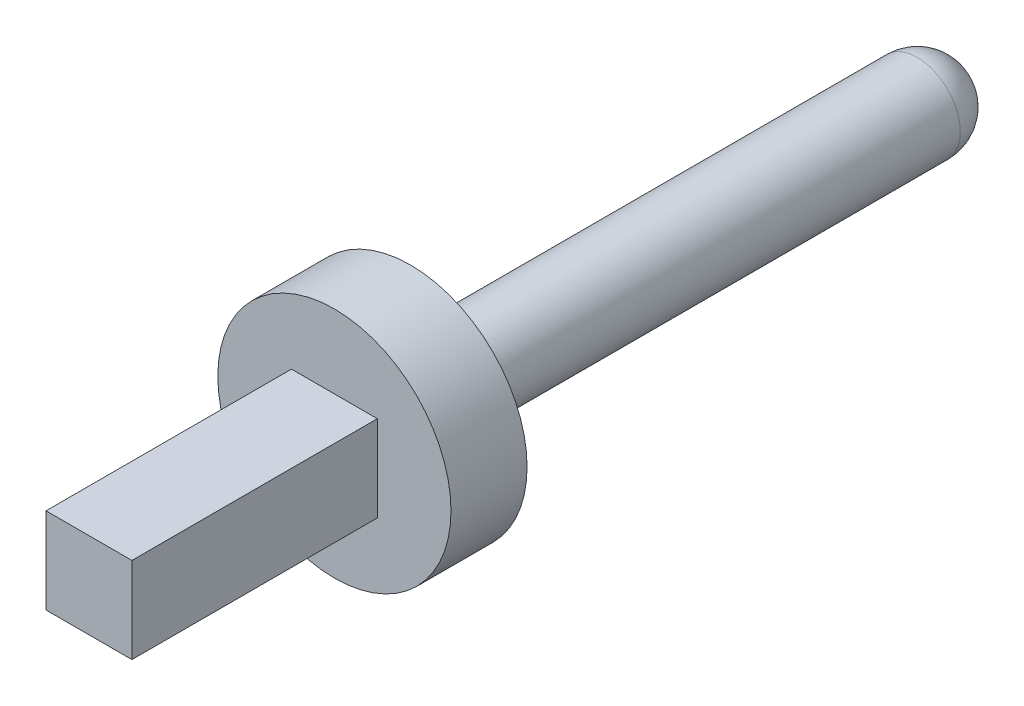
ISO-10303-21;
HEADER;
FILE_DESCRIPTION(('STEP AP214'),'2;1');
FILE_NAME('part.step','',(''),(''),'','','');
FILE_SCHEMA(('AUTOMOTIVE_DESIGN { 1 0 10303 214 1 1 1 1 }'));
ENDSEC;
DATA;
#1=APPLICATION_CONTEXT('core data for automotive mechanical design processes');
#2=APPLICATION_PROTOCOL_DEFINITION('international standard','automotive_design',2000,#1);
#3=PRODUCT_CONTEXT('',#1,'mechanical');
#4=PRODUCT('Part','Part','',(#3));
#5=PRODUCT_RELATED_PRODUCT_CATEGORY('part','',(#4));
#6=PRODUCT_DEFINITION_FORMATION('','',#4);
#7=PRODUCT_DEFINITION_CONTEXT('part definition',#1,'design');
#8=PRODUCT_DEFINITION('design','',#6,#7);
#9=PRODUCT_DEFINITION_SHAPE('','',#8);
#10=(LENGTH_UNIT() NAMED_UNIT(*) SI_UNIT(.MILLI.,.METRE.));
#11=(NAMED_UNIT(*) PLANE_ANGLE_UNIT() SI_UNIT($,.RADIAN.));
#12=(NAMED_UNIT(*) SI_UNIT($,.STERADIAN.) SOLID_ANGLE_UNIT());
#13=UNCERTAINTY_MEASURE_WITH_UNIT(LENGTH_MEASURE(1.E-05),#10,'distance_accuracy_value','');
#14=(GEOMETRIC_REPRESENTATION_CONTEXT(3) GLOBAL_UNCERTAINTY_ASSIGNED_CONTEXT((#13)) GLOBAL_UNIT_ASSIGNED_CONTEXT((#10,
#11,#12)) REPRESENTATION_CONTEXT('',''));
#15=CARTESIAN_POINT('',(0.,0.,0.));
#16=DIRECTION('',(0.,0.,1.));
#17=DIRECTION('',(1.,0.,0.));
#18=AXIS2_PLACEMENT_3D('',#15,#16,#17);
#19=CARTESIAN_POINT('',(5.,-2.25,-0.62));
#20=DIRECTION('',(0.,0.,-1.));
#21=DIRECTION('',(1.,0.,0.));
#22=AXIS2_PLACEMENT_3D('',#19,#20,#21);
#23=CYLINDRICAL_SURFACE('',#22,0.95);
#24=CARTESIAN_POINT('',(5.,-2.25,-0.62));
#25=DIRECTION('',(0.,0.,1.));
#26=DIRECTION('',(0.,1.,0.));
#27=AXIS2_PLACEMENT_3D('',#24,#25,#26);
#28=CIRCLE('',#27,0.95);
#29=CARTESIAN_POINT('',(5.,-1.3,-0.62));
#30=VERTEX_POINT('',#29);
#31=EDGE_CURVE('E26',#30,#30,#28,.T.);
#32=ORIENTED_EDGE('',*,*,#31,.T.);
#33=EDGE_LOOP('',(#32));
#34=FACE_BOUND('',#33,.T.);
#35=CARTESIAN_POINT('',(5.,-2.25,0.));
#36=DIRECTION('',(0.,0.,1.));
#37=DIRECTION('',(0.,1.,0.));
#38=AXIS2_PLACEMENT_3D('',#35,#36,#37);
#39=CIRCLE('',#38,0.95);
#40=CARTESIAN_POINT('',(5.,-1.3,0.));
#41=VERTEX_POINT('',#40);
#42=EDGE_CURVE('E20',#41,#41,#39,.T.);
#43=ORIENTED_EDGE('',*,*,#42,.F.);
#44=EDGE_LOOP('',(#43));
#45=FACE_BOUND('',#44,.T.);
#46=ADVANCED_FACE('F17',(#34,#45),#23,.T.);
#47=CARTESIAN_POINT('',(5.,-2.25,-5.1));
#48=DIRECTION('',(0.,0.,-1.));
#49=DIRECTION('',(1.,0.,0.));
#50=AXIS2_PLACEMENT_3D('',#47,#48,#49);
#51=CYLINDRICAL_SURFACE('',#50,0.35);
#52=CARTESIAN_POINT('',(5.,-2.25,-4.75));
#53=DIRECTION('',(0.,0.,1.));
#54=DIRECTION('',(1.,0.,0.));
#55=AXIS2_PLACEMENT_3D('',#52,#53,#54);
#56=CIRCLE('',#55,0.35);
#57=CARTESIAN_POINT('',(5.35,-2.25,-4.75));
#58=VERTEX_POINT('',#57);
#59=EDGE_CURVE('E105',#58,#58,#56,.T.);
#60=ORIENTED_EDGE('',*,*,#59,.T.);
#61=EDGE_LOOP('',(#60));
#62=FACE_BOUND('',#61,.T.);
#63=CARTESIAN_POINT('',(5.,-2.25,-0.62));
#64=DIRECTION('',(0.,0.,1.));
#65=DIRECTION('',(0.,1.,0.));
#66=AXIS2_PLACEMENT_3D('',#63,#64,#65);
#67=CIRCLE('',#66,0.35);
#68=CARTESIAN_POINT('',(5.,-1.9,-0.62));
#69=VERTEX_POINT('',#68);
#70=EDGE_CURVE('E11',#69,#69,#67,.T.);
#71=ORIENTED_EDGE('',*,*,#70,.F.);
#72=EDGE_LOOP('',(#71));
#73=FACE_BOUND('',#72,.T.);
#74=ADVANCED_FACE('F170',(#62,#73),#51,.T.);
#75=CARTESIAN_POINT('',(5.,-2.25,-0.62));
#76=DIRECTION('',(0.,0.,1.));
#77=DIRECTION('',(1.,0.,0.));
#78=AXIS2_PLACEMENT_3D('',#75,#76,#77);
#79=PLANE('',#78);
#80=ORIENTED_EDGE('',*,*,#70,.T.);
#81=EDGE_LOOP('',(#80));
#82=FACE_BOUND('',#81,.T.);
#83=ORIENTED_EDGE('',*,*,#31,.F.);
#84=EDGE_LOOP('',(#83));
#85=FACE_BOUND('',#84,.T.);
#86=ADVANCED_FACE('F174',(#82,#85),#79,.F.);
#87=CARTESIAN_POINT('',(5.,-2.25,0.));
#88=DIRECTION('',(0.,0.,1.));
#89=DIRECTION('',(1.,0.,0.));
#90=AXIS2_PLACEMENT_3D('',#87,#88,#89);
#91=PLANE('',#90);
#92=DIRECTION('',(1.,0.,0.));
#93=VECTOR('',#92,1.);
#94=CARTESIAN_POINT('',(4.65,-2.6,0.));
#95=LINE('',#94,#93);
#96=CARTESIAN_POINT('',(4.65,-2.6,0.));
#97=VERTEX_POINT('',#96);
#98=CARTESIAN_POINT('',(5.35,-2.6,0.));
#99=VERTEX_POINT('',#98);
#100=EDGE_CURVE('E95',#97,#99,#95,.T.);
#101=ORIENTED_EDGE('',*,*,#100,.F.);
#102=DIRECTION('',(0.,-1.,0.));
#103=VECTOR('',#102,1.);
#104=CARTESIAN_POINT('',(4.65,-1.9,0.));
#105=LINE('',#104,#103);
#106=CARTESIAN_POINT('',(4.65,-1.9,0.));
#107=VERTEX_POINT('',#106);
#108=EDGE_CURVE('E110',#107,#97,#105,.T.);
#109=ORIENTED_EDGE('',*,*,#108,.F.);
#110=DIRECTION('',(-1.,0.,0.));
#111=VECTOR('',#110,1.);
#112=CARTESIAN_POINT('',(5.35,-1.9,0.));
#113=LINE('',#112,#111);
#114=CARTESIAN_POINT('',(5.35,-1.9,0.));
#115=VERTEX_POINT('',#114);
#116=EDGE_CURVE('E86',#115,#107,#113,.T.);
#117=ORIENTED_EDGE('',*,*,#116,.F.);
#118=DIRECTION('',(0.,1.,0.));
#119=VECTOR('',#118,1.);
#120=CARTESIAN_POINT('',(5.35,-2.6,0.));
#121=LINE('',#120,#119);
#122=EDGE_CURVE('E113',#99,#115,#121,.T.);
#123=ORIENTED_EDGE('',*,*,#122,.F.);
#124=EDGE_LOOP('',(#101,#109,#117,#123));
#125=FACE_BOUND('',#124,.T.);
#126=ORIENTED_EDGE('',*,*,#42,.T.);
#127=EDGE_LOOP('',(#126));
#128=FACE_BOUND('',#127,.T.);
#129=ADVANCED_FACE('F107',(#125,#128),#91,.T.);
#130=CARTESIAN_POINT('',(4.65,-2.6,0.));
#131=DIRECTION('',(0.,-1.,0.));
#132=DIRECTION('',(0.,0.,-1.));
#133=AXIS2_PLACEMENT_3D('',#130,#131,#132);
#134=PLANE('',#133);
#135=DIRECTION('',(1.,0.,0.));
#136=VECTOR('',#135,1.);
#137=CARTESIAN_POINT('',(4.65,-2.6,2.));
#138=LINE('',#137,#136);
#139=CARTESIAN_POINT('',(4.65,-2.6,2.));
#140=VERTEX_POINT('',#139);
#141=CARTESIAN_POINT('',(5.35,-2.6,2.));
#142=VERTEX_POINT('',#141);
#143=EDGE_CURVE('E60',#140,#142,#138,.T.);
#144=ORIENTED_EDGE('',*,*,#143,.F.);
#145=DIRECTION('',(0.,0.,1.));
#146=VECTOR('',#145,1.);
#147=CARTESIAN_POINT('',(4.65,-2.6,0.));
#148=LINE('',#147,#146);
#149=EDGE_CURVE('E117',#97,#140,#148,.T.);
#150=ORIENTED_EDGE('',*,*,#149,.F.);
#151=ORIENTED_EDGE('',*,*,#100,.T.);
#152=DIRECTION('',(0.,0.,1.));
#153=VECTOR('',#152,1.);
#154=CARTESIAN_POINT('',(5.35,-2.6,0.));
#155=LINE('',#154,#153);
#156=EDGE_CURVE('E134',#99,#142,#155,.T.);
#157=ORIENTED_EDGE('',*,*,#156,.T.);
#158=EDGE_LOOP('',(#144,#150,#151,#157));
#159=FACE_BOUND('',#158,.T.);
#160=ADVANCED_FACE('F118',(#159),#134,.T.);
#161=CARTESIAN_POINT('',(4.65,-2.6,2.));
#162=DIRECTION('',(0.,0.,1.));
#163=DIRECTION('',(1.,0.,0.));
#164=AXIS2_PLACEMENT_3D('',#161,#162,#163);
#165=PLANE('',#164);
#166=DIRECTION('',(0.,-1.,0.));
#167=VECTOR('',#166,1.);
#168=CARTESIAN_POINT('',(4.65,-1.9,2.));
#169=LINE('',#168,#167);
#170=CARTESIAN_POINT('',(4.65,-1.9,2.));
#171=VERTEX_POINT('',#170);
#172=EDGE_CURVE('E130',#171,#140,#169,.T.);
#173=ORIENTED_EDGE('',*,*,#172,.T.);
#174=ORIENTED_EDGE('',*,*,#143,.T.);
#175=DIRECTION('',(0.,1.,0.));
#176=VECTOR('',#175,1.);
#177=CARTESIAN_POINT('',(5.35,-2.6,2.));
#178=LINE('',#177,#176);
#179=CARTESIAN_POINT('',(5.35,-1.9,2.));
#180=VERTEX_POINT('',#179);
#181=EDGE_CURVE('E137',#142,#180,#178,.T.);
#182=ORIENTED_EDGE('',*,*,#181,.T.);
#183=DIRECTION('',(-1.,0.,0.));
#184=VECTOR('',#183,1.);
#185=CARTESIAN_POINT('',(5.35,-1.9,2.));
#186=LINE('',#185,#184);
#187=EDGE_CURVE('E74',#180,#171,#186,.T.);
#188=ORIENTED_EDGE('',*,*,#187,.T.);
#189=EDGE_LOOP('',(#173,#174,#182,#188));
#190=FACE_BOUND('',#189,.T.);
#191=ADVANCED_FACE('F156',(#190),#165,.T.);
#192=CARTESIAN_POINT('',(5.35,-1.9,0.));
#193=DIRECTION('',(0.,1.,0.));
#194=DIRECTION('',(1.,0.,0.));
#195=AXIS2_PLACEMENT_3D('',#192,#193,#194);
#196=PLANE('',#195);
#197=ORIENTED_EDGE('',*,*,#187,.F.);
#198=DIRECTION('',(0.,0.,1.));
#199=VECTOR('',#198,1.);
#200=CARTESIAN_POINT('',(5.35,-1.9,0.));
#201=LINE('',#200,#199);
#202=EDGE_CURVE('E139',#115,#180,#201,.T.);
#203=ORIENTED_EDGE('',*,*,#202,.F.);
#204=ORIENTED_EDGE('',*,*,#116,.T.);
#205=DIRECTION('',(0.,0.,1.));
#206=VECTOR('',#205,1.);
#207=CARTESIAN_POINT('',(4.65,-1.9,0.));
#208=LINE('',#207,#206);
#209=EDGE_CURVE('E124',#107,#171,#208,.T.);
#210=ORIENTED_EDGE('',*,*,#209,.T.);
#211=EDGE_LOOP('',(#197,#203,#204,#210));
#212=FACE_BOUND('',#211,.T.);
#213=ADVANCED_FACE('F158',(#212),#196,.T.);
#214=CARTESIAN_POINT('',(5.35,-2.6,0.));
#215=DIRECTION('',(1.,0.,0.));
#216=DIRECTION('',(0.,1.,0.));
#217=AXIS2_PLACEMENT_3D('',#214,#215,#216);
#218=PLANE('',#217);
#219=ORIENTED_EDGE('',*,*,#181,.F.);
#220=ORIENTED_EDGE('',*,*,#156,.F.);
#221=ORIENTED_EDGE('',*,*,#122,.T.);
#222=ORIENTED_EDGE('',*,*,#202,.T.);
#223=EDGE_LOOP('',(#219,#220,#221,#222));
#224=FACE_BOUND('',#223,.T.);
#225=ADVANCED_FACE('F165',(#224),#218,.T.);
#226=CARTESIAN_POINT('',(5.,-2.25,-4.75));
#227=DIRECTION('',(0.,0.,1.));
#228=DIRECTION('',(1.,0.,0.));
#229=AXIS2_PLACEMENT_3D('',#226,#227,#228);
#230=SPHERICAL_SURFACE('',#229,0.35);
#231=ORIENTED_EDGE('',*,*,#59,.F.);
#232=EDGE_LOOP('',(#231));
#233=FACE_BOUND('',#232,.T.);
#234=ADVANCED_FACE('F186',(#233),#230,.T.);
#235=CARTESIAN_POINT('',(4.65,-1.9,0.));
#236=DIRECTION('',(-1.,0.,0.));
#237=DIRECTION('',(0.,0.,1.));
#238=AXIS2_PLACEMENT_3D('',#235,#236,#237);
#239=PLANE('',#238);
#240=ORIENTED_EDGE('',*,*,#172,.F.);
#241=ORIENTED_EDGE('',*,*,#209,.F.);
#242=ORIENTED_EDGE('',*,*,#108,.T.);
#243=ORIENTED_EDGE('',*,*,#149,.T.);
#244=EDGE_LOOP('',(#240,#241,#242,#243));
#245=FACE_BOUND('',#244,.T.);
#246=ADVANCED_FACE('F123',(#245),#239,.T.);
#247=CLOSED_SHELL('',(#46,#74,#86,#129,#160,#191,#213,#225,#234,#246));
#248=MANIFOLD_SOLID_BREP('B1',#247);
#249=ADVANCED_BREP_SHAPE_REPRESENTATION('',(#18,#248),#14);
#250=SHAPE_DEFINITION_REPRESENTATION(#9,#249);
ENDSEC;
END-ISO-10303-21;
